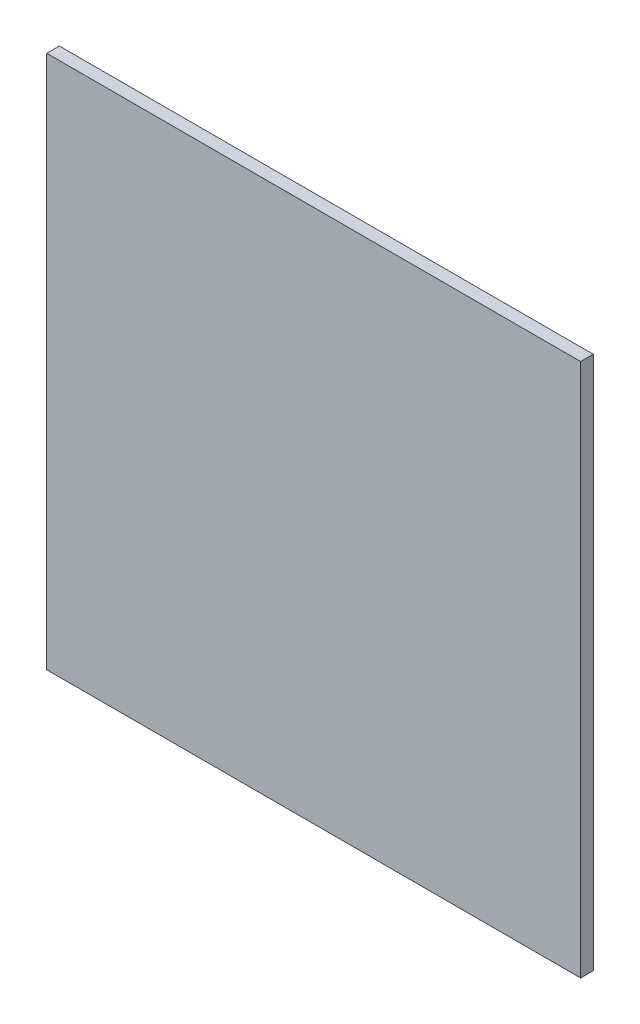
ISO-10303-21;
HEADER;
FILE_DESCRIPTION(('STEP AP214'),'2;1');
FILE_NAME('part.step','',(''),(''),'','','');
FILE_SCHEMA(('AUTOMOTIVE_DESIGN { 1 0 10303 214 1 1 1 1 }'));
ENDSEC;
DATA;
#1=APPLICATION_CONTEXT('core data for automotive mechanical design processes');
#2=APPLICATION_PROTOCOL_DEFINITION('international standard','automotive_design',2000,#1);
#3=PRODUCT_CONTEXT('',#1,'mechanical');
#4=PRODUCT('Part','Part','',(#3));
#5=PRODUCT_RELATED_PRODUCT_CATEGORY('part','',(#4));
#6=PRODUCT_DEFINITION_FORMATION('','',#4);
#7=PRODUCT_DEFINITION_CONTEXT('part definition',#1,'design');
#8=PRODUCT_DEFINITION('design','',#6,#7);
#9=PRODUCT_DEFINITION_SHAPE('','',#8);
#10=(LENGTH_UNIT() NAMED_UNIT(*) SI_UNIT(.MILLI.,.METRE.));
#11=(NAMED_UNIT(*) PLANE_ANGLE_UNIT() SI_UNIT($,.RADIAN.));
#12=(NAMED_UNIT(*) SI_UNIT($,.STERADIAN.) SOLID_ANGLE_UNIT());
#13=UNCERTAINTY_MEASURE_WITH_UNIT(LENGTH_MEASURE(1.E-05),#10,'distance_accuracy_value','');
#14=(GEOMETRIC_REPRESENTATION_CONTEXT(3) GLOBAL_UNCERTAINTY_ASSIGNED_CONTEXT((#13)) GLOBAL_UNIT_ASSIGNED_CONTEXT((#10,
#11,#12)) REPRESENTATION_CONTEXT('',''));
#15=CARTESIAN_POINT('',(0.,0.,0.));
#16=DIRECTION('',(0.,0.,1.));
#17=DIRECTION('',(1.,0.,0.));
#18=AXIS2_PLACEMENT_3D('',#15,#16,#17);
#19=CARTESIAN_POINT('',(8.57508,3.625,0.));
#20=DIRECTION('',(0.,0.,-1.));
#21=DIRECTION('',(-1.,0.,0.));
#22=AXIS2_PLACEMENT_3D('',#19,#20,#21);
#23=PLANE('',#22);
#24=DIRECTION('',(1.,0.,0.));
#25=VECTOR('',#24,1.);
#26=CARTESIAN_POINT('',(7.85008,4.35,0.));
#27=LINE('',#26,#25);
#28=CARTESIAN_POINT('',(7.85008,4.35,0.));
#29=VERTEX_POINT('',#28);
#30=CARTESIAN_POINT('',(9.30008,4.35,0.));
#31=VERTEX_POINT('',#30);
#32=EDGE_CURVE('E55',#29,#31,#27,.T.);
#33=ORIENTED_EDGE('',*,*,#32,.T.);
#34=DIRECTION('',(0.,1.,0.));
#35=VECTOR('',#34,1.);
#36=CARTESIAN_POINT('',(9.30008,4.35,0.));
#37=LINE('',#36,#35);
#38=CARTESIAN_POINT('',(9.30008,2.9,0.));
#39=VERTEX_POINT('',#38);
#40=EDGE_CURVE('E57',#31,#39,#37,.F.);
#41=ORIENTED_EDGE('',*,*,#40,.T.);
#42=DIRECTION('',(1.,0.,0.));
#43=VECTOR('',#42,1.);
#44=CARTESIAN_POINT('',(9.30008,2.9,0.));
#45=LINE('',#44,#43);
#46=CARTESIAN_POINT('',(7.85008,2.9,0.));
#47=VERTEX_POINT('',#46);
#48=EDGE_CURVE('E20',#39,#47,#45,.F.);
#49=ORIENTED_EDGE('',*,*,#48,.T.);
#50=DIRECTION('',(0.,1.,0.));
#51=VECTOR('',#50,1.);
#52=CARTESIAN_POINT('',(7.85008,2.9,0.));
#53=LINE('',#52,#51);
#54=EDGE_CURVE('E80',#47,#29,#53,.T.);
#55=ORIENTED_EDGE('',*,*,#54,.T.);
#56=EDGE_LOOP('',(#33,#41,#49,#55));
#57=FACE_BOUND('',#56,.T.);
#58=ADVANCED_FACE('F17',(#57),#23,.T.);
#59=CARTESIAN_POINT('',(9.30008,2.9,0.));
#60=DIRECTION('',(0.,1.,0.));
#61=DIRECTION('',(0.,0.,1.));
#62=AXIS2_PLACEMENT_3D('',#59,#60,#61);
#63=PLANE('',#62);
#64=DIRECTION('',(0.,0.,-1.));
#65=VECTOR('',#64,1.);
#66=CARTESIAN_POINT('',(7.85008,2.9,0.));
#67=LINE('',#66,#65);
#68=CARTESIAN_POINT('',(7.85008,2.9,0.03429));
#69=VERTEX_POINT('',#68);
#70=EDGE_CURVE('E68',#69,#47,#67,.T.);
#71=ORIENTED_EDGE('',*,*,#70,.T.);
#72=ORIENTED_EDGE('',*,*,#48,.F.);
#73=DIRECTION('',(0.,0.,1.));
#74=VECTOR('',#73,1.);
#75=CARTESIAN_POINT('',(9.30008,2.9,0.));
#76=LINE('',#75,#74);
#77=CARTESIAN_POINT('',(9.30008,2.9,0.03429));
#78=VERTEX_POINT('',#77);
#79=EDGE_CURVE('E63',#39,#78,#76,.T.);
#80=ORIENTED_EDGE('',*,*,#79,.T.);
#81=DIRECTION('',(1.,0.,0.));
#82=VECTOR('',#81,1.);
#83=CARTESIAN_POINT('',(8.57508,2.9,0.03429));
#84=LINE('',#83,#82);
#85=EDGE_CURVE('E83',#69,#78,#84,.T.);
#86=ORIENTED_EDGE('',*,*,#85,.F.);
#87=EDGE_LOOP('',(#71,#72,#80,#86));
#88=FACE_BOUND('',#87,.T.);
#89=ADVANCED_FACE('F65',(#88),#63,.F.);
#90=CARTESIAN_POINT('',(9.30008,4.35,0.));
#91=DIRECTION('',(-1.,0.,0.));
#92=DIRECTION('',(0.,0.,1.));
#93=AXIS2_PLACEMENT_3D('',#90,#91,#92);
#94=PLANE('',#93);
#95=ORIENTED_EDGE('',*,*,#79,.F.);
#96=ORIENTED_EDGE('',*,*,#40,.F.);
#97=DIRECTION('',(0.,0.,-1.));
#98=VECTOR('',#97,1.);
#99=CARTESIAN_POINT('',(9.30008,4.35,0.));
#100=LINE('',#99,#98);
#101=CARTESIAN_POINT('',(9.30008,4.35,0.03429));
#102=VERTEX_POINT('',#101);
#103=EDGE_CURVE('E75',#31,#102,#100,.F.);
#104=ORIENTED_EDGE('',*,*,#103,.T.);
#105=DIRECTION('',(0.,1.,0.));
#106=VECTOR('',#105,1.);
#107=CARTESIAN_POINT('',(9.30008,3.625,0.03429));
#108=LINE('',#107,#106);
#109=EDGE_CURVE('E72',#78,#102,#108,.T.);
#110=ORIENTED_EDGE('',*,*,#109,.F.);
#111=EDGE_LOOP('',(#95,#96,#104,#110));
#112=FACE_BOUND('',#111,.T.);
#113=ADVANCED_FACE('F70',(#112),#94,.F.);
#114=CARTESIAN_POINT('',(7.85008,4.35,0.));
#115=DIRECTION('',(0.,-1.,0.));
#116=DIRECTION('',(0.,0.,-1.));
#117=AXIS2_PLACEMENT_3D('',#114,#115,#116);
#118=PLANE('',#117);
#119=ORIENTED_EDGE('',*,*,#103,.F.);
#120=ORIENTED_EDGE('',*,*,#32,.F.);
#121=DIRECTION('',(0.,0.,-1.));
#122=VECTOR('',#121,1.);
#123=CARTESIAN_POINT('',(7.85008,4.35,0.));
#124=LINE('',#123,#122);
#125=CARTESIAN_POINT('',(7.85008,4.35,0.03429));
#126=VERTEX_POINT('',#125);
#127=EDGE_CURVE('E35',#29,#126,#124,.F.);
#128=ORIENTED_EDGE('',*,*,#127,.T.);
#129=DIRECTION('',(1.,0.,0.));
#130=VECTOR('',#129,1.);
#131=CARTESIAN_POINT('',(8.57508,4.35,0.03429));
#132=LINE('',#131,#130);
#133=EDGE_CURVE('E26',#102,#126,#132,.F.);
#134=ORIENTED_EDGE('',*,*,#133,.F.);
#135=EDGE_LOOP('',(#119,#120,#128,#134));
#136=FACE_BOUND('',#135,.T.);
#137=ADVANCED_FACE('F89',(#136),#118,.F.);
#138=CARTESIAN_POINT('',(7.85008,2.9,0.));
#139=DIRECTION('',(1.,0.,0.));
#140=DIRECTION('',(0.,0.,-1.));
#141=AXIS2_PLACEMENT_3D('',#138,#139,#140);
#142=PLANE('',#141);
#143=ORIENTED_EDGE('',*,*,#127,.F.);
#144=ORIENTED_EDGE('',*,*,#54,.F.);
#145=ORIENTED_EDGE('',*,*,#70,.F.);
#146=DIRECTION('',(0.,1.,0.));
#147=VECTOR('',#146,1.);
#148=CARTESIAN_POINT('',(7.85008,3.625,0.03429));
#149=LINE('',#148,#147);
#150=EDGE_CURVE('E11',#126,#69,#149,.F.);
#151=ORIENTED_EDGE('',*,*,#150,.F.);
#152=EDGE_LOOP('',(#143,#144,#145,#151));
#153=FACE_BOUND('',#152,.T.);
#154=ADVANCED_FACE('F91',(#153),#142,.F.);
#155=CARTESIAN_POINT('',(8.57508,3.625,0.03429));
#156=DIRECTION('',(0.,0.,1.));
#157=DIRECTION('',(1.,0.,0.));
#158=AXIS2_PLACEMENT_3D('',#155,#156,#157);
#159=PLANE('',#158);
#160=ORIENTED_EDGE('',*,*,#133,.T.);
#161=ORIENTED_EDGE('',*,*,#150,.T.);
#162=ORIENTED_EDGE('',*,*,#85,.T.);
#163=ORIENTED_EDGE('',*,*,#109,.T.);
#164=EDGE_LOOP('',(#160,#161,#162,#163));
#165=FACE_BOUND('',#164,.T.);
#166=ADVANCED_FACE('F88',(#165),#159,.T.);
#167=CLOSED_SHELL('',(#58,#89,#113,#137,#154,#166));
#168=MANIFOLD_SOLID_BREP('B1',#167);
#169=ADVANCED_BREP_SHAPE_REPRESENTATION('',(#18,#168),#14);
#170=SHAPE_DEFINITION_REPRESENTATION(#9,#169);
ENDSEC;
END-ISO-10303-21;
